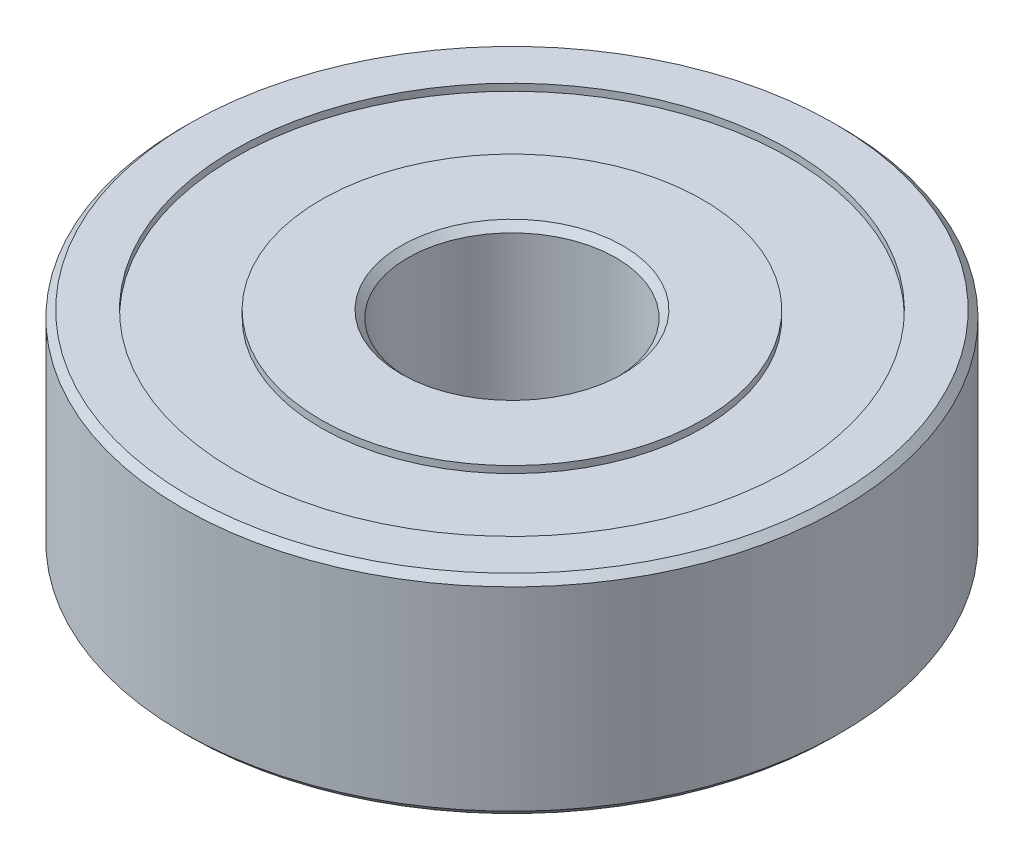
ISO-10303-21;
HEADER;
FILE_DESCRIPTION(('STEP AP214'),'2;1');
FILE_NAME('part.step','',(''),(''),'','','');
FILE_SCHEMA(('AUTOMOTIVE_DESIGN { 1 0 10303 214 1 1 1 1 }'));
ENDSEC;
DATA;
#1=APPLICATION_CONTEXT('core data for automotive mechanical design processes');
#2=APPLICATION_PROTOCOL_DEFINITION('international standard','automotive_design',2000,#1);
#3=PRODUCT_CONTEXT('',#1,'mechanical');
#4=PRODUCT('Part','Part','',(#3));
#5=PRODUCT_RELATED_PRODUCT_CATEGORY('part','',(#4));
#6=PRODUCT_DEFINITION_FORMATION('','',#4);
#7=PRODUCT_DEFINITION_CONTEXT('part definition',#1,'design');
#8=PRODUCT_DEFINITION('design','',#6,#7);
#9=PRODUCT_DEFINITION_SHAPE('','',#8);
#10=(LENGTH_UNIT() NAMED_UNIT(*) SI_UNIT(.MILLI.,.METRE.));
#11=(NAMED_UNIT(*) PLANE_ANGLE_UNIT() SI_UNIT($,.RADIAN.));
#12=(NAMED_UNIT(*) SI_UNIT($,.STERADIAN.) SOLID_ANGLE_UNIT());
#13=UNCERTAINTY_MEASURE_WITH_UNIT(LENGTH_MEASURE(1.E-05),#10,'distance_accuracy_value','');
#14=(GEOMETRIC_REPRESENTATION_CONTEXT(3) GLOBAL_UNCERTAINTY_ASSIGNED_CONTEXT((#13)) GLOBAL_UNIT_ASSIGNED_CONTEXT((#10,
#11,#12)) REPRESENTATION_CONTEXT('',''));
#15=CARTESIAN_POINT('',(0.,0.,0.));
#16=DIRECTION('',(0.,0.,1.));
#17=DIRECTION('',(1.,0.,0.));
#18=AXIS2_PLACEMENT_3D('',#15,#16,#17);
#19=CARTESIAN_POINT('',(0.,0.,0.));
#20=DIRECTION('',(0.,1.,0.));
#21=DIRECTION('',(0.,0.,1.));
#22=AXIS2_PLACEMENT_3D('',#19,#20,#21);
#23=PLANE('',#22);
#24=CARTESIAN_POINT('',(0.,0.,0.));
#25=DIRECTION('',(0.,1.,0.));
#26=DIRECTION('',(0.,0.,1.));
#27=AXIS2_PLACEMENT_3D('',#24,#25,#26);
#28=CIRCLE('',#27,3.2);
#29=CARTESIAN_POINT('',(0.,0.,3.2));
#30=VERTEX_POINT('',#29);
#31=EDGE_CURVE('E10',#30,#30,#28,.T.);
#32=ORIENTED_EDGE('',*,*,#31,.T.);
#33=EDGE_LOOP('',(#32));
#34=FACE_BOUND('',#33,.T.);
#35=CARTESIAN_POINT('',(0.,0.,0.));
#36=DIRECTION('',(0.,-1.,0.));
#37=DIRECTION('',(0.,0.,-1.));
#38=AXIS2_PLACEMENT_3D('',#35,#36,#37);
#39=CIRCLE('',#38,5.5);
#40=CARTESIAN_POINT('',(0.,0.,-5.5));
#41=VERTEX_POINT('',#40);
#42=EDGE_CURVE('E86',#41,#41,#39,.T.);
#43=ORIENTED_EDGE('',*,*,#42,.T.);
#44=EDGE_LOOP('',(#43));
#45=FACE_BOUND('',#44,.T.);
#46=ADVANCED_FACE('F34',(#34,#45),#23,.F.);
#47=CARTESIAN_POINT('',(0.,6.,0.));
#48=DIRECTION('',(0.,1.,0.));
#49=DIRECTION('',(0.,0.,1.));
#50=AXIS2_PLACEMENT_3D('',#47,#48,#49);
#51=PLANE('',#50);
#52=CARTESIAN_POINT('',(0.,6.,0.));
#53=DIRECTION('',(0.,1.,0.));
#54=DIRECTION('',(0.,0.,1.));
#55=AXIS2_PLACEMENT_3D('',#52,#53,#54);
#56=CIRCLE('',#55,3.20000000000001);
#57=CARTESIAN_POINT('',(0.,6.,3.20000000000001));
#58=VERTEX_POINT('',#57);
#59=EDGE_CURVE('E42',#58,#58,#56,.F.);
#60=ORIENTED_EDGE('',*,*,#59,.T.);
#61=EDGE_LOOP('',(#60));
#62=FACE_BOUND('',#61,.T.);
#63=CARTESIAN_POINT('',(0.,6.,0.));
#64=DIRECTION('',(0.,1.,0.));
#65=DIRECTION('',(0.,0.,1.));
#66=AXIS2_PLACEMENT_3D('',#63,#64,#65);
#67=CIRCLE('',#66,5.5);
#68=CARTESIAN_POINT('',(0.,6.,5.5));
#69=VERTEX_POINT('',#68);
#70=EDGE_CURVE('E74',#69,#69,#67,.T.);
#71=ORIENTED_EDGE('',*,*,#70,.T.);
#72=EDGE_LOOP('',(#71));
#73=FACE_BOUND('',#72,.T.);
#74=ADVANCED_FACE('F121',(#62,#73),#51,.T.);
#75=CARTESIAN_POINT('',(0.,6.,0.));
#76=DIRECTION('',(0.,1.,0.));
#77=DIRECTION('',(0.,0.,1.));
#78=AXIS2_PLACEMENT_3D('',#75,#76,#77);
#79=CIRCLE('',#78,9.3);
#80=CARTESIAN_POINT('',(0.,6.,9.3));
#81=VERTEX_POINT('',#80);
#82=EDGE_CURVE('E64',#81,#81,#79,.T.);
#83=ORIENTED_EDGE('',*,*,#82,.T.);
#84=EDGE_LOOP('',(#83));
#85=FACE_BOUND('',#84,.T.);
#86=CARTESIAN_POINT('',(0.,6.,0.));
#87=DIRECTION('',(0.,1.,0.));
#88=DIRECTION('',(0.,0.,1.));
#89=AXIS2_PLACEMENT_3D('',#86,#87,#88);
#90=CIRCLE('',#89,8.);
#91=CARTESIAN_POINT('',(0.,6.,8.));
#92=VERTEX_POINT('',#91);
#93=EDGE_CURVE('E68',#92,#92,#90,.T.);
#94=ORIENTED_EDGE('',*,*,#93,.F.);
#95=EDGE_LOOP('',(#94));
#96=FACE_BOUND('',#95,.T.);
#97=ADVANCED_FACE('F111',(#85,#96),#51,.T.);
#98=CARTESIAN_POINT('',(0.,0.,0.));
#99=DIRECTION('',(0.,1.,0.));
#100=DIRECTION('',(0.,0.,1.));
#101=AXIS2_PLACEMENT_3D('',#98,#99,#100);
#102=CIRCLE('',#101,9.3);
#103=CARTESIAN_POINT('',(0.,0.,9.3));
#104=VERTEX_POINT('',#103);
#105=EDGE_CURVE('E55',#104,#104,#102,.F.);
#106=ORIENTED_EDGE('',*,*,#105,.T.);
#107=EDGE_LOOP('',(#106));
#108=FACE_BOUND('',#107,.T.);
#109=CARTESIAN_POINT('',(0.,0.,0.));
#110=DIRECTION('',(0.,-1.,0.));
#111=DIRECTION('',(0.,0.,-1.));
#112=AXIS2_PLACEMENT_3D('',#109,#110,#111);
#113=CIRCLE('',#112,8.);
#114=CARTESIAN_POINT('',(0.,0.,-8.));
#115=VERTEX_POINT('',#114);
#116=EDGE_CURVE('E80',#115,#115,#113,.T.);
#117=ORIENTED_EDGE('',*,*,#116,.F.);
#118=EDGE_LOOP('',(#117));
#119=FACE_BOUND('',#118,.T.);
#120=ADVANCED_FACE('F108',(#108,#119),#23,.F.);
#121=CARTESIAN_POINT('',(0.,6.,0.));
#122=DIRECTION('',(0.,-1.,0.));
#123=DIRECTION('',(0.,0.,-1.));
#124=AXIS2_PLACEMENT_3D('',#121,#122,#123);
#125=CYLINDRICAL_SURFACE('',#124,9.5);
#126=CARTESIAN_POINT('',(0.,5.80000000000001,0.));
#127=DIRECTION('',(0.,1.,0.));
#128=DIRECTION('',(0.,0.,1.));
#129=AXIS2_PLACEMENT_3D('',#126,#127,#128);
#130=CIRCLE('',#129,9.5);
#131=CARTESIAN_POINT('',(0.,5.80000000000001,9.5));
#132=VERTEX_POINT('',#131);
#133=EDGE_CURVE('E58',#132,#132,#130,.F.);
#134=ORIENTED_EDGE('',*,*,#133,.T.);
#135=EDGE_LOOP('',(#134));
#136=FACE_BOUND('',#135,.T.);
#137=CARTESIAN_POINT('',(0.,0.200000000000004,0.));
#138=DIRECTION('',(0.,1.,0.));
#139=DIRECTION('',(0.,0.,1.));
#140=AXIS2_PLACEMENT_3D('',#137,#138,#139);
#141=CIRCLE('',#140,9.5);
#142=CARTESIAN_POINT('',(0.,0.200000000000004,9.5));
#143=VERTEX_POINT('',#142);
#144=EDGE_CURVE('E61',#143,#143,#141,.T.);
#145=ORIENTED_EDGE('',*,*,#144,.T.);
#146=EDGE_LOOP('',(#145));
#147=FACE_BOUND('',#146,.T.);
#148=ADVANCED_FACE('F110',(#136,#147),#125,.T.);
#149=CARTESIAN_POINT('',(0.,6.,0.));
#150=DIRECTION('',(0.,-1.,0.));
#151=DIRECTION('',(0.,0.,-1.));
#152=AXIS2_PLACEMENT_3D('',#149,#150,#151);
#153=CYLINDRICAL_SURFACE('',#152,3.);
#154=CARTESIAN_POINT('',(0.,5.8,0.));
#155=DIRECTION('',(0.,1.,0.));
#156=DIRECTION('',(0.,0.,1.));
#157=AXIS2_PLACEMENT_3D('',#154,#155,#156);
#158=CIRCLE('',#157,3.);
#159=CARTESIAN_POINT('',(0.,5.8,3.));
#160=VERTEX_POINT('',#159);
#161=EDGE_CURVE('E46',#160,#160,#158,.T.);
#162=ORIENTED_EDGE('',*,*,#161,.T.);
#163=EDGE_LOOP('',(#162));
#164=FACE_BOUND('',#163,.T.);
#165=CARTESIAN_POINT('',(0.,0.200000000000001,0.));
#166=DIRECTION('',(0.,1.,0.));
#167=DIRECTION('',(0.,0.,1.));
#168=AXIS2_PLACEMENT_3D('',#165,#166,#167);
#169=CIRCLE('',#168,3.);
#170=CARTESIAN_POINT('',(0.,0.200000000000001,3.));
#171=VERTEX_POINT('',#170);
#172=EDGE_CURVE('E50',#171,#171,#169,.F.);
#173=ORIENTED_EDGE('',*,*,#172,.T.);
#174=EDGE_LOOP('',(#173));
#175=FACE_BOUND('',#174,.T.);
#176=ADVANCED_FACE('F118',(#164,#175),#153,.F.);
#177=CARTESIAN_POINT('',(0.,5.8,0.));
#178=DIRECTION('',(0.,1.,0.));
#179=DIRECTION('',(0.,0.,1.));
#180=AXIS2_PLACEMENT_3D('',#177,#178,#179);
#181=CYLINDRICAL_SURFACE('',#180,8.);
#182=CARTESIAN_POINT('',(0.,5.8,0.));
#183=DIRECTION('',(0.,1.,0.));
#184=DIRECTION('',(0.,0.,1.));
#185=AXIS2_PLACEMENT_3D('',#182,#183,#184);
#186=CIRCLE('',#185,8.);
#187=CARTESIAN_POINT('',(0.,5.8,8.));
#188=VERTEX_POINT('',#187);
#189=EDGE_CURVE('E67',#188,#188,#186,.T.);
#190=ORIENTED_EDGE('',*,*,#189,.F.);
#191=EDGE_LOOP('',(#190));
#192=FACE_BOUND('',#191,.T.);
#193=ORIENTED_EDGE('',*,*,#93,.T.);
#194=EDGE_LOOP('',(#193));
#195=FACE_BOUND('',#194,.T.);
#196=ADVANCED_FACE('F146',(#192,#195),#181,.F.);
#197=CARTESIAN_POINT('',(0.,5.8,0.));
#198=DIRECTION('',(0.,1.,0.));
#199=DIRECTION('',(0.,0.,1.));
#200=AXIS2_PLACEMENT_3D('',#197,#198,#199);
#201=PLANE('',#200);
#202=CARTESIAN_POINT('',(0.,5.8,0.));
#203=DIRECTION('',(0.,1.,0.));
#204=DIRECTION('',(0.,0.,1.));
#205=AXIS2_PLACEMENT_3D('',#202,#203,#204);
#206=CIRCLE('',#205,5.5);
#207=CARTESIAN_POINT('',(0.,5.8,5.5));
#208=VERTEX_POINT('',#207);
#209=EDGE_CURVE('E71',#208,#208,#206,.T.);
#210=ORIENTED_EDGE('',*,*,#209,.F.);
#211=EDGE_LOOP('',(#210));
#212=FACE_BOUND('',#211,.T.);
#213=ORIENTED_EDGE('',*,*,#189,.T.);
#214=EDGE_LOOP('',(#213));
#215=FACE_BOUND('',#214,.T.);
#216=ADVANCED_FACE('F142',(#212,#215),#201,.T.);
#217=CARTESIAN_POINT('',(0.,5.8,0.));
#218=DIRECTION('',(0.,1.,0.));
#219=DIRECTION('',(0.,0.,1.));
#220=AXIS2_PLACEMENT_3D('',#217,#218,#219);
#221=CYLINDRICAL_SURFACE('',#220,5.5);
#222=ORIENTED_EDGE('',*,*,#209,.T.);
#223=EDGE_LOOP('',(#222));
#224=FACE_BOUND('',#223,.T.);
#225=ORIENTED_EDGE('',*,*,#70,.F.);
#226=EDGE_LOOP('',(#225));
#227=FACE_BOUND('',#226,.T.);
#228=ADVANCED_FACE('F104',(#224,#227),#221,.T.);
#229=CARTESIAN_POINT('',(0.,0.2,0.));
#230=DIRECTION('',(0.,-1.,0.));
#231=DIRECTION('',(0.,0.,-1.));
#232=AXIS2_PLACEMENT_3D('',#229,#230,#231);
#233=CYLINDRICAL_SURFACE('',#232,8.);
#234=CARTESIAN_POINT('',(0.,0.2,0.));
#235=DIRECTION('',(0.,-1.,0.));
#236=DIRECTION('',(0.,0.,-1.));
#237=AXIS2_PLACEMENT_3D('',#234,#235,#236);
#238=CIRCLE('',#237,8.);
#239=CARTESIAN_POINT('',(0.,0.2,-8.));
#240=VERTEX_POINT('',#239);
#241=EDGE_CURVE('E77',#240,#240,#238,.T.);
#242=ORIENTED_EDGE('',*,*,#241,.F.);
#243=EDGE_LOOP('',(#242));
#244=FACE_BOUND('',#243,.T.);
#245=ORIENTED_EDGE('',*,*,#116,.T.);
#246=EDGE_LOOP('',(#245));
#247=FACE_BOUND('',#246,.T.);
#248=ADVANCED_FACE('F98',(#244,#247),#233,.F.);
#249=CARTESIAN_POINT('',(0.,0.2,0.));
#250=DIRECTION('',(0.,-1.,0.));
#251=DIRECTION('',(0.,0.,-1.));
#252=AXIS2_PLACEMENT_3D('',#249,#250,#251);
#253=PLANE('',#252);
#254=CARTESIAN_POINT('',(0.,0.2,0.));
#255=DIRECTION('',(0.,-1.,0.));
#256=DIRECTION('',(0.,0.,-1.));
#257=AXIS2_PLACEMENT_3D('',#254,#255,#256);
#258=CIRCLE('',#257,5.5);
#259=CARTESIAN_POINT('',(0.,0.2,-5.5));
#260=VERTEX_POINT('',#259);
#261=EDGE_CURVE('E83',#260,#260,#258,.T.);
#262=ORIENTED_EDGE('',*,*,#261,.F.);
#263=EDGE_LOOP('',(#262));
#264=FACE_BOUND('',#263,.T.);
#265=ORIENTED_EDGE('',*,*,#241,.T.);
#266=EDGE_LOOP('',(#265));
#267=FACE_BOUND('',#266,.T.);
#268=ADVANCED_FACE('F95',(#264,#267),#253,.T.);
#269=CARTESIAN_POINT('',(0.,0.2,0.));
#270=DIRECTION('',(0.,-1.,0.));
#271=DIRECTION('',(0.,0.,-1.));
#272=AXIS2_PLACEMENT_3D('',#269,#270,#271);
#273=CYLINDRICAL_SURFACE('',#272,5.5);
#274=ORIENTED_EDGE('',*,*,#261,.T.);
#275=EDGE_LOOP('',(#274));
#276=FACE_BOUND('',#275,.T.);
#277=ORIENTED_EDGE('',*,*,#42,.F.);
#278=EDGE_LOOP('',(#277));
#279=FACE_BOUND('',#278,.T.);
#280=ADVANCED_FACE('F92',(#276,#279),#273,.T.);
#281=CARTESIAN_POINT('',(0.,6.,0.));
#282=DIRECTION('',(0.,-1.,0.));
#283=DIRECTION('',(0.,0.,-1.));
#284=AXIS2_PLACEMENT_3D('',#281,#282,#283);
#285=CONICAL_SURFACE('',#284,9.3,0.785398163397453);
#286=ORIENTED_EDGE('',*,*,#133,.F.);
#287=EDGE_LOOP('',(#286));
#288=FACE_BOUND('',#287,.T.);
#289=ORIENTED_EDGE('',*,*,#82,.F.);
#290=EDGE_LOOP('',(#289));
#291=FACE_BOUND('',#290,.T.);
#292=ADVANCED_FACE('F131',(#288,#291),#285,.T.);
#293=CARTESIAN_POINT('',(0.,0.200000000000004,0.));
#294=DIRECTION('',(0.,1.,0.));
#295=DIRECTION('',(0.,0.,1.));
#296=AXIS2_PLACEMENT_3D('',#293,#294,#295);
#297=CONICAL_SURFACE('',#296,9.5,0.785398163397444);
#298=ORIENTED_EDGE('',*,*,#105,.F.);
#299=EDGE_LOOP('',(#298));
#300=FACE_BOUND('',#299,.T.);
#301=ORIENTED_EDGE('',*,*,#144,.F.);
#302=EDGE_LOOP('',(#301));
#303=FACE_BOUND('',#302,.T.);
#304=ADVANCED_FACE('F136',(#300,#303),#297,.T.);
#305=CARTESIAN_POINT('',(0.,5.8,0.));
#306=DIRECTION('',(0.,1.,0.));
#307=DIRECTION('',(0.,0.,1.));
#308=AXIS2_PLACEMENT_3D('',#305,#306,#307);
#309=CONICAL_SURFACE('',#308,3.,0.785398163397449);
#310=ORIENTED_EDGE('',*,*,#59,.F.);
#311=EDGE_LOOP('',(#310));
#312=FACE_BOUND('',#311,.T.);
#313=ORIENTED_EDGE('',*,*,#161,.F.);
#314=EDGE_LOOP('',(#313));
#315=FACE_BOUND('',#314,.T.);
#316=ADVANCED_FACE('F161',(#312,#315),#309,.F.);
#317=CARTESIAN_POINT('',(0.,0.,0.));
#318=DIRECTION('',(0.,-1.,0.));
#319=DIRECTION('',(0.,0.,-1.));
#320=AXIS2_PLACEMENT_3D('',#317,#318,#319);
#321=CONICAL_SURFACE('',#320,3.2,0.785398163397446);
#322=ORIENTED_EDGE('',*,*,#172,.F.);
#323=EDGE_LOOP('',(#322));
#324=FACE_BOUND('',#323,.T.);
#325=ORIENTED_EDGE('',*,*,#31,.F.);
#326=EDGE_LOOP('',(#325));
#327=FACE_BOUND('',#326,.T.);
#328=ADVANCED_FACE('F37',(#324,#327),#321,.F.);
#329=CLOSED_SHELL('',(#46,#74,#97,#120,#148,#176,#196,#216,#228,#248,#268,#280,#292,#304,#316,#328));
#330=MANIFOLD_SOLID_BREP('B2',#329);
#331=ADVANCED_BREP_SHAPE_REPRESENTATION('',(#18,#330),#14);
#332=SHAPE_DEFINITION_REPRESENTATION(#9,#331);
ENDSEC;
END-ISO-10303-21;
